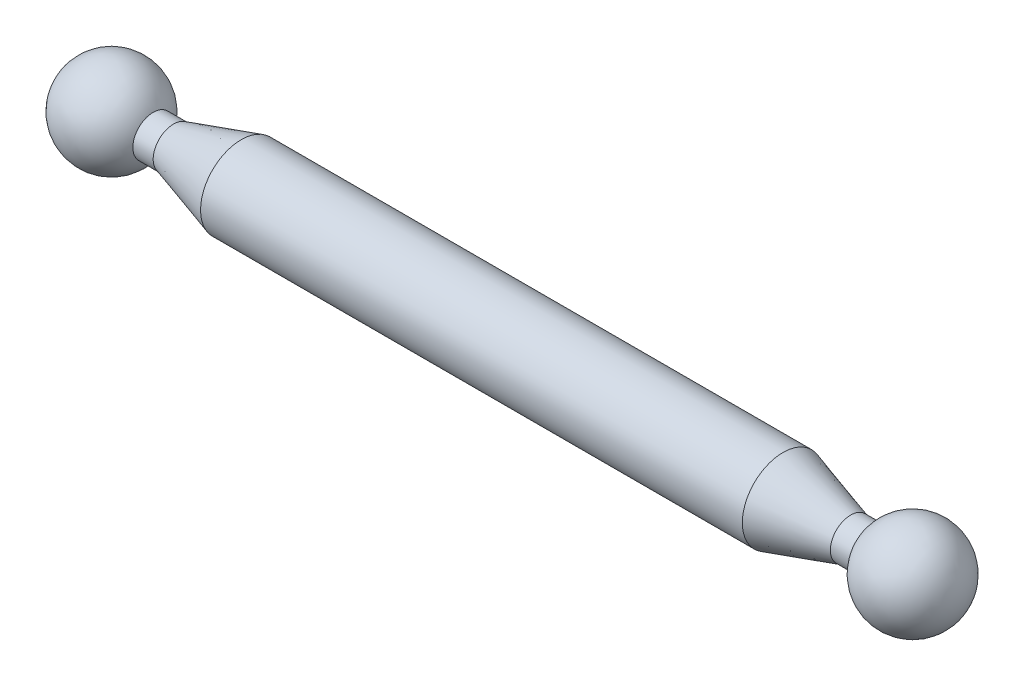
ISO-10303-21;
HEADER;
FILE_DESCRIPTION(('STEP AP214'),'2;1');
FILE_NAME('part.step','',(''),(''),'','','');
FILE_SCHEMA(('AUTOMOTIVE_DESIGN { 1 0 10303 214 1 1 1 1 }'));
ENDSEC;
DATA;
#1=APPLICATION_CONTEXT('core data for automotive mechanical design processes');
#2=APPLICATION_PROTOCOL_DEFINITION('international standard','automotive_design',2000,#1);
#3=PRODUCT_CONTEXT('',#1,'mechanical');
#4=PRODUCT('Part','Part','',(#3));
#5=PRODUCT_RELATED_PRODUCT_CATEGORY('part','',(#4));
#6=PRODUCT_DEFINITION_FORMATION('','',#4);
#7=PRODUCT_DEFINITION_CONTEXT('part definition',#1,'design');
#8=PRODUCT_DEFINITION('design','',#6,#7);
#9=PRODUCT_DEFINITION_SHAPE('','',#8);
#10=(LENGTH_UNIT() NAMED_UNIT(*) SI_UNIT(.MILLI.,.METRE.));
#11=(NAMED_UNIT(*) PLANE_ANGLE_UNIT() SI_UNIT($,.RADIAN.));
#12=(NAMED_UNIT(*) SI_UNIT($,.STERADIAN.) SOLID_ANGLE_UNIT());
#13=UNCERTAINTY_MEASURE_WITH_UNIT(LENGTH_MEASURE(1.E-05),#10,'distance_accuracy_value','');
#14=(GEOMETRIC_REPRESENTATION_CONTEXT(3) GLOBAL_UNCERTAINTY_ASSIGNED_CONTEXT((#13)) GLOBAL_UNIT_ASSIGNED_CONTEXT((#10,
#11,#12)) REPRESENTATION_CONTEXT('',''));
#15=CARTESIAN_POINT('',(0.,0.,0.));
#16=DIRECTION('',(0.,0.,1.));
#17=DIRECTION('',(1.,0.,0.));
#18=AXIS2_PLACEMENT_3D('',#15,#16,#17);
#19=CARTESIAN_POINT('',(295.769230769231,0.,0.));
#20=DIRECTION('',(0.,0.,1.));
#21=DIRECTION('',(1.,0.,0.));
#22=AXIS2_PLACEMENT_3D('',#19,#20,#21);
#23=SPHERICAL_SURFACE('',#22,34.2307692307692);
#24=CARTESIAN_POINT('',(295.769230769231,0.,0.));
#25=DIRECTION('',(-1.,0.,0.));
#26=DIRECTION('',(0.,0.,1.));
#27=AXIS2_PLACEMENT_3D('',#24,#25,#26);
#28=SPHERICAL_SURFACE('',#27,34.2307692307692);
#29=CARTESIAN_POINT('',(265.,0.,0.));
#30=DIRECTION('',(-1.,0.,0.));
#31=DIRECTION('',(0.,0.,1.));
#32=AXIS2_PLACEMENT_3D('',#29,#30,#31);
#33=CIRCLE('',#32,15.);
#34=CARTESIAN_POINT('',(265.,0.,15.));
#35=VERTEX_POINT('',#34);
#36=EDGE_CURVE('E10',#35,#35,#33,.T.);
#37=ORIENTED_EDGE('',*,*,#36,.F.);
#38=EDGE_LOOP('',(#37));
#39=FACE_BOUND('',#38,.T.);
#40=ADVANCED_FACE('F37',(#39),#28,.T.);
#41=CARTESIAN_POINT('',(-265.,0.,0.));
#42=DIRECTION('',(-1.,0.,0.));
#43=DIRECTION('',(0.,0.,1.));
#44=AXIS2_PLACEMENT_3D('',#41,#42,#43);
#45=CYLINDRICAL_SURFACE('',#44,15.);
#46=CARTESIAN_POINT('',(250.,0.,0.));
#47=DIRECTION('',(-1.,0.,0.));
#48=DIRECTION('',(0.,0.,1.));
#49=AXIS2_PLACEMENT_3D('',#46,#47,#48);
#50=CIRCLE('',#49,15.);
#51=CARTESIAN_POINT('',(250.,0.,15.));
#52=VERTEX_POINT('',#51);
#53=EDGE_CURVE('E46',#52,#52,#50,.T.);
#54=ORIENTED_EDGE('',*,*,#53,.F.);
#55=EDGE_LOOP('',(#54));
#56=FACE_BOUND('',#55,.T.);
#57=ORIENTED_EDGE('',*,*,#36,.T.);
#58=EDGE_LOOP('',(#57));
#59=FACE_BOUND('',#58,.T.);
#60=ADVANCED_FACE('F83',(#56,#59),#45,.T.);
#61=CARTESIAN_POINT('',(250.,0.,0.));
#62=DIRECTION('',(-1.,0.,0.));
#63=DIRECTION('',(0.,0.,1.));
#64=AXIS2_PLACEMENT_3D('',#61,#62,#63);
#65=CONICAL_SURFACE('',#64,15.,0.291456794477868);
#66=CARTESIAN_POINT('',(200.,0.,0.));
#67=DIRECTION('',(-1.,0.,0.));
#68=DIRECTION('',(0.,0.,1.));
#69=AXIS2_PLACEMENT_3D('',#66,#67,#68);
#70=CIRCLE('',#69,30.);
#71=CARTESIAN_POINT('',(200.,0.,30.));
#72=VERTEX_POINT('',#71);
#73=EDGE_CURVE('E51',#72,#72,#70,.T.);
#74=ORIENTED_EDGE('',*,*,#73,.F.);
#75=EDGE_LOOP('',(#74));
#76=FACE_BOUND('',#75,.T.);
#77=ORIENTED_EDGE('',*,*,#53,.T.);
#78=EDGE_LOOP('',(#77));
#79=FACE_BOUND('',#78,.T.);
#80=ADVANCED_FACE('F88',(#76,#79),#65,.T.);
#81=CARTESIAN_POINT('',(-265.,0.,0.));
#82=DIRECTION('',(-1.,0.,0.));
#83=DIRECTION('',(0.,0.,1.));
#84=AXIS2_PLACEMENT_3D('',#81,#82,#83);
#85=CYLINDRICAL_SURFACE('',#84,30.);
#86=CARTESIAN_POINT('',(-200.,0.,0.));
#87=DIRECTION('',(-1.,0.,0.));
#88=DIRECTION('',(0.,0.,1.));
#89=AXIS2_PLACEMENT_3D('',#86,#87,#88);
#90=CIRCLE('',#89,30.);
#91=CARTESIAN_POINT('',(-200.,0.,30.));
#92=VERTEX_POINT('',#91);
#93=EDGE_CURVE('E57',#92,#92,#90,.T.);
#94=ORIENTED_EDGE('',*,*,#93,.F.);
#95=EDGE_LOOP('',(#94));
#96=FACE_BOUND('',#95,.T.);
#97=ORIENTED_EDGE('',*,*,#73,.T.);
#98=EDGE_LOOP('',(#97));
#99=FACE_BOUND('',#98,.T.);
#100=ADVANCED_FACE('F79',(#96,#99),#85,.T.);
#101=CARTESIAN_POINT('',(-200.,0.,0.));
#102=DIRECTION('',(1.,0.,0.));
#103=DIRECTION('',(0.,0.,-1.));
#104=AXIS2_PLACEMENT_3D('',#101,#102,#103);
#105=CONICAL_SURFACE('',#104,30.,0.291456794477868);
#106=CARTESIAN_POINT('',(-250.,0.,0.));
#107=DIRECTION('',(-1.,0.,0.));
#108=DIRECTION('',(0.,0.,1.));
#109=AXIS2_PLACEMENT_3D('',#106,#107,#108);
#110=CIRCLE('',#109,15.);
#111=CARTESIAN_POINT('',(-250.,0.,15.));
#112=VERTEX_POINT('',#111);
#113=EDGE_CURVE('E61',#112,#112,#110,.T.);
#114=ORIENTED_EDGE('',*,*,#113,.F.);
#115=EDGE_LOOP('',(#114));
#116=FACE_BOUND('',#115,.T.);
#117=ORIENTED_EDGE('',*,*,#93,.T.);
#118=EDGE_LOOP('',(#117));
#119=FACE_BOUND('',#118,.T.);
#120=ADVANCED_FACE('F73',(#116,#119),#105,.T.);
#121=CARTESIAN_POINT('',(-265.,0.,0.));
#122=DIRECTION('',(-1.,0.,0.));
#123=DIRECTION('',(0.,0.,1.));
#124=AXIS2_PLACEMENT_3D('',#121,#122,#123);
#125=CYLINDRICAL_SURFACE('',#124,15.);
#126=CARTESIAN_POINT('',(-265.,0.,0.));
#127=DIRECTION('',(-1.,0.,0.));
#128=DIRECTION('',(0.,0.,1.));
#129=AXIS2_PLACEMENT_3D('',#126,#127,#128);
#130=CIRCLE('',#129,15.);
#131=CARTESIAN_POINT('',(-265.,0.,15.));
#132=VERTEX_POINT('',#131);
#133=EDGE_CURVE('E41',#132,#132,#130,.T.);
#134=ORIENTED_EDGE('',*,*,#133,.F.);
#135=EDGE_LOOP('',(#134));
#136=FACE_BOUND('',#135,.T.);
#137=ORIENTED_EDGE('',*,*,#113,.T.);
#138=EDGE_LOOP('',(#137));
#139=FACE_BOUND('',#138,.T.);
#140=ADVANCED_FACE('F71',(#136,#139),#125,.T.);
#141=CARTESIAN_POINT('',(-295.769230769231,0.,0.));
#142=DIRECTION('',(0.,0.,1.));
#143=DIRECTION('',(1.,0.,0.));
#144=AXIS2_PLACEMENT_3D('',#141,#142,#143);
#145=SPHERICAL_SURFACE('',#144,34.2307692307692);
#146=CARTESIAN_POINT('',(-295.769230769231,0.,0.));
#147=DIRECTION('',(-1.,0.,0.));
#148=DIRECTION('',(0.,0.,1.));
#149=AXIS2_PLACEMENT_3D('',#146,#147,#148);
#150=SPHERICAL_SURFACE('',#149,34.2307692307692);
#151=ORIENTED_EDGE('',*,*,#133,.T.);
#152=EDGE_LOOP('',(#151));
#153=FACE_BOUND('',#152,.T.);
#154=ADVANCED_FACE('F39',(#153),#150,.T.);
#155=CLOSED_SHELL('',(#40,#60,#80,#100,#120,#140,#154));
#156=MANIFOLD_SOLID_BREP('B2',#155);
#157=ADVANCED_BREP_SHAPE_REPRESENTATION('',(#18,#156),#14);
#158=SHAPE_DEFINITION_REPRESENTATION(#9,#157);
ENDSEC;
END-ISO-10303-21;
